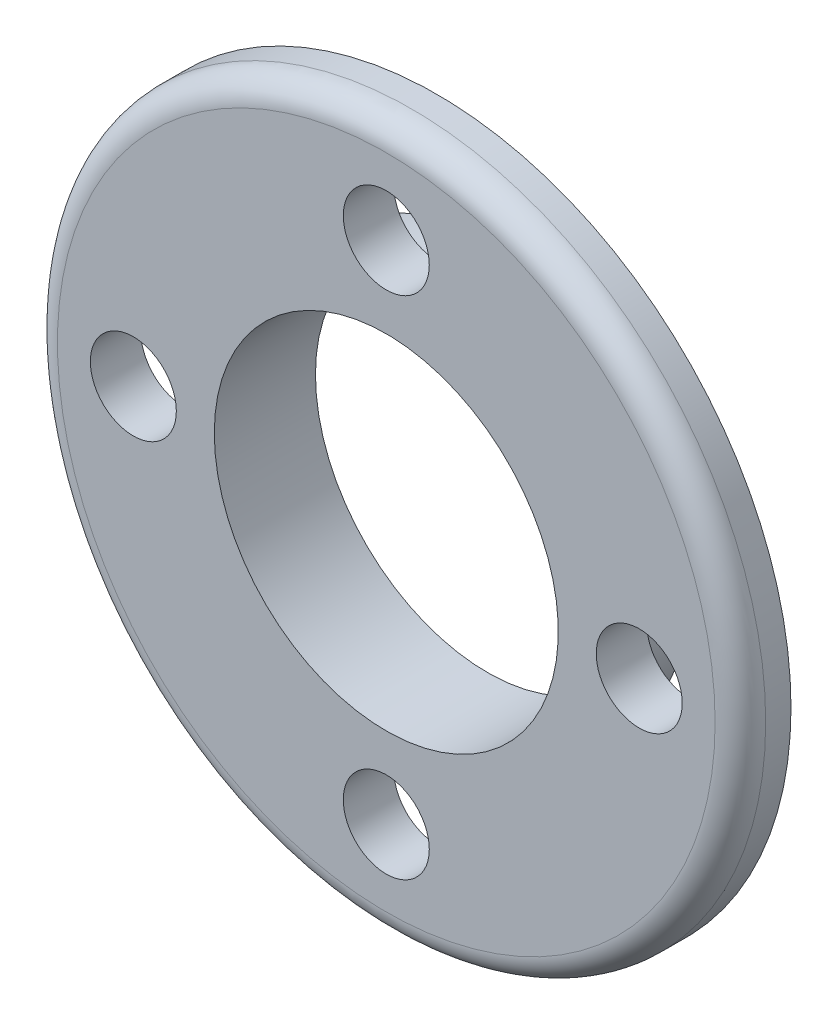
ISO-10303-21;
HEADER;
FILE_DESCRIPTION(('STEP AP214'),'2;1');
FILE_NAME('part.step','',(''),(''),'','','');
FILE_SCHEMA(('AUTOMOTIVE_DESIGN { 1 0 10303 214 1 1 1 1 }'));
ENDSEC;
DATA;
#1=APPLICATION_CONTEXT('core data for automotive mechanical design processes');
#2=APPLICATION_PROTOCOL_DEFINITION('international standard','automotive_design',2000,#1);
#3=PRODUCT_CONTEXT('',#1,'mechanical');
#4=PRODUCT('Part','Part','',(#3));
#5=PRODUCT_RELATED_PRODUCT_CATEGORY('part','',(#4));
#6=PRODUCT_DEFINITION_FORMATION('','',#4);
#7=PRODUCT_DEFINITION_CONTEXT('part definition',#1,'design');
#8=PRODUCT_DEFINITION('design','',#6,#7);
#9=PRODUCT_DEFINITION_SHAPE('','',#8);
#10=(LENGTH_UNIT() NAMED_UNIT(*) SI_UNIT(.MILLI.,.METRE.));
#11=(NAMED_UNIT(*) PLANE_ANGLE_UNIT() SI_UNIT($,.RADIAN.));
#12=(NAMED_UNIT(*) SI_UNIT($,.STERADIAN.) SOLID_ANGLE_UNIT());
#13=UNCERTAINTY_MEASURE_WITH_UNIT(LENGTH_MEASURE(1.E-05),#10,'distance_accuracy_value','');
#14=(GEOMETRIC_REPRESENTATION_CONTEXT(3) GLOBAL_UNCERTAINTY_ASSIGNED_CONTEXT((#13)) GLOBAL_UNIT_ASSIGNED_CONTEXT((#10,
#11,#12)) REPRESENTATION_CONTEXT('',''));
#15=CARTESIAN_POINT('',(0.,0.,0.));
#16=DIRECTION('',(0.,0.,1.));
#17=DIRECTION('',(1.,0.,0.));
#18=AXIS2_PLACEMENT_3D('',#15,#16,#17);
#19=CARTESIAN_POINT('',(0.,14.,1.));
#20=DIRECTION('',(0.,0.,1.));
#21=DIRECTION('',(1.,0.,0.));
#22=AXIS2_PLACEMENT_3D('',#19,#20,#21);
#23=PLANE('',#22);
#24=CARTESIAN_POINT('',(0.,0.,1.));
#25=DIRECTION('',(0.,0.,1.));
#26=DIRECTION('',(1.,0.,0.));
#27=AXIS2_PLACEMENT_3D('',#24,#25,#26);
#28=CIRCLE('',#27,13.);
#29=CARTESIAN_POINT('',(13.,0.,1.));
#30=VERTEX_POINT('',#29);
#31=EDGE_CURVE('E10',#30,#30,#28,.T.);
#32=ORIENTED_EDGE('',*,*,#31,.T.);
#33=EDGE_LOOP('',(#32));
#34=FACE_BOUND('',#33,.T.);
#35=CARTESIAN_POINT('',(1.04744440165294E-13,-10.,1.));
#36=DIRECTION('',(0.,0.,1.));
#37=DIRECTION('',(1.,0.,0.));
#38=AXIS2_PLACEMENT_3D('',#35,#36,#37);
#39=CIRCLE('',#38,1.7);
#40=CARTESIAN_POINT('',(1.7000000000001,-10.,1.));
#41=VERTEX_POINT('',#40);
#42=EDGE_CURVE('E101',#41,#41,#39,.T.);
#43=ORIENTED_EDGE('',*,*,#42,.F.);
#44=EDGE_LOOP('',(#43));
#45=FACE_BOUND('',#44,.T.);
#46=CARTESIAN_POINT('',(-10.,0.,1.));
#47=DIRECTION('',(0.,0.,1.));
#48=DIRECTION('',(1.,0.,0.));
#49=AXIS2_PLACEMENT_3D('',#46,#47,#48);
#50=CIRCLE('',#49,1.7);
#51=CARTESIAN_POINT('',(-8.3,0.,1.));
#52=VERTEX_POINT('',#51);
#53=EDGE_CURVE('E93',#52,#52,#50,.T.);
#54=ORIENTED_EDGE('',*,*,#53,.F.);
#55=EDGE_LOOP('',(#54));
#56=FACE_BOUND('',#55,.T.);
#57=CARTESIAN_POINT('',(0.,10.,1.));
#58=DIRECTION('',(0.,0.,1.));
#59=DIRECTION('',(1.,0.,0.));
#60=AXIS2_PLACEMENT_3D('',#57,#58,#59);
#61=CIRCLE('',#60,1.7);
#62=CARTESIAN_POINT('',(1.69999999999996,10.,1.));
#63=VERTEX_POINT('',#62);
#64=EDGE_CURVE('E63',#63,#63,#61,.T.);
#65=ORIENTED_EDGE('',*,*,#64,.F.);
#66=EDGE_LOOP('',(#65));
#67=FACE_BOUND('',#66,.T.);
#68=CARTESIAN_POINT('',(10.,0.,1.));
#69=DIRECTION('',(0.,0.,1.));
#70=DIRECTION('',(1.,0.,0.));
#71=AXIS2_PLACEMENT_3D('',#68,#69,#70);
#72=CIRCLE('',#71,1.7);
#73=CARTESIAN_POINT('',(11.7,0.,1.));
#74=VERTEX_POINT('',#73);
#75=EDGE_CURVE('E62',#74,#74,#72,.T.);
#76=ORIENTED_EDGE('',*,*,#75,.F.);
#77=EDGE_LOOP('',(#76));
#78=FACE_BOUND('',#77,.T.);
#79=CARTESIAN_POINT('',(0.,0.,1.));
#80=DIRECTION('',(0.,0.,-1.));
#81=DIRECTION('',(-1.,0.,0.));
#82=AXIS2_PLACEMENT_3D('',#79,#80,#81);
#83=CIRCLE('',#82,6.8);
#84=CARTESIAN_POINT('',(-6.8,0.,1.));
#85=VERTEX_POINT('',#84);
#86=EDGE_CURVE('E50',#85,#85,#83,.T.);
#87=ORIENTED_EDGE('',*,*,#86,.T.);
#88=EDGE_LOOP('',(#87));
#89=FACE_BOUND('',#88,.T.);
#90=ADVANCED_FACE('F37',(#34,#45,#56,#67,#78,#89),#23,.T.);
#91=CARTESIAN_POINT('',(0.,0.,-88.99));
#92=DIRECTION('',(0.,0.,-1.));
#93=DIRECTION('',(-1.,0.,0.));
#94=AXIS2_PLACEMENT_3D('',#91,#92,#93);
#95=CYLINDRICAL_SURFACE('',#94,6.8);
#96=CARTESIAN_POINT('',(0.,0.,-3.));
#97=DIRECTION('',(0.,0.,-1.));
#98=DIRECTION('',(-1.,0.,0.));
#99=AXIS2_PLACEMENT_3D('',#96,#97,#98);
#100=CIRCLE('',#99,6.8);
#101=CARTESIAN_POINT('',(-6.8,0.,-3.));
#102=VERTEX_POINT('',#101);
#103=EDGE_CURVE('E55',#102,#102,#100,.T.);
#104=ORIENTED_EDGE('',*,*,#103,.T.);
#105=EDGE_LOOP('',(#104));
#106=FACE_BOUND('',#105,.T.);
#107=ORIENTED_EDGE('',*,*,#86,.F.);
#108=EDGE_LOOP('',(#107));
#109=FACE_BOUND('',#108,.T.);
#110=ADVANCED_FACE('F110',(#106,#109),#95,.F.);
#111=CARTESIAN_POINT('',(0.,6.8,-3.));
#112=DIRECTION('',(0.,0.,-1.));
#113=DIRECTION('',(-1.,0.,0.));
#114=AXIS2_PLACEMENT_3D('',#111,#112,#113);
#115=PLANE('',#114);
#116=CARTESIAN_POINT('',(0.,0.,-3.));
#117=DIRECTION('',(0.,0.,-1.));
#118=DIRECTION('',(-1.,0.,0.));
#119=AXIS2_PLACEMENT_3D('',#116,#117,#118);
#120=CIRCLE('',#119,8.);
#121=CARTESIAN_POINT('',(-8.,0.,-3.));
#122=VERTEX_POINT('',#121);
#123=EDGE_CURVE('E72',#122,#122,#120,.T.);
#124=ORIENTED_EDGE('',*,*,#123,.T.);
#125=EDGE_LOOP('',(#124));
#126=FACE_BOUND('',#125,.T.);
#127=ORIENTED_EDGE('',*,*,#103,.F.);
#128=EDGE_LOOP('',(#127));
#129=FACE_BOUND('',#128,.T.);
#130=ADVANCED_FACE('F120',(#126,#129),#115,.T.);
#131=CARTESIAN_POINT('',(0.,0.,-88.99));
#132=DIRECTION('',(0.,0.,-1.));
#133=DIRECTION('',(-1.,0.,0.));
#134=AXIS2_PLACEMENT_3D('',#131,#132,#133);
#135=CYLINDRICAL_SURFACE('',#134,8.);
#136=CARTESIAN_POINT('',(0.,0.,-1.));
#137=DIRECTION('',(0.,0.,-1.));
#138=DIRECTION('',(-1.,0.,0.));
#139=AXIS2_PLACEMENT_3D('',#136,#137,#138);
#140=CIRCLE('',#139,8.);
#141=CARTESIAN_POINT('',(-8.,0.,-1.));
#142=VERTEX_POINT('',#141);
#143=EDGE_CURVE('E76',#142,#142,#140,.T.);
#144=ORIENTED_EDGE('',*,*,#143,.T.);
#145=EDGE_LOOP('',(#144));
#146=FACE_BOUND('',#145,.T.);
#147=ORIENTED_EDGE('',*,*,#123,.F.);
#148=EDGE_LOOP('',(#147));
#149=FACE_BOUND('',#148,.T.);
#150=ADVANCED_FACE('F126',(#146,#149),#135,.T.);
#151=CARTESIAN_POINT('',(0.,14.,-1.));
#152=DIRECTION('',(0.,0.,-1.));
#153=DIRECTION('',(-1.,0.,0.));
#154=AXIS2_PLACEMENT_3D('',#151,#152,#153);
#155=PLANE('',#154);
#156=CARTESIAN_POINT('',(1.04744440165294E-13,-10.,-1.));
#157=DIRECTION('',(0.,0.,-1.));
#158=DIRECTION('',(-1.,0.,0.));
#159=AXIS2_PLACEMENT_3D('',#156,#157,#158);
#160=CIRCLE('',#159,1.7);
#161=CARTESIAN_POINT('',(-1.69999999999989,-10.,-1.));
#162=VERTEX_POINT('',#161);
#163=EDGE_CURVE('E97',#162,#162,#160,.T.);
#164=ORIENTED_EDGE('',*,*,#163,.F.);
#165=EDGE_LOOP('',(#164));
#166=FACE_BOUND('',#165,.T.);
#167=CARTESIAN_POINT('',(-10.,0.,-1.));
#168=DIRECTION('',(0.,0.,-1.));
#169=DIRECTION('',(-1.,0.,0.));
#170=AXIS2_PLACEMENT_3D('',#167,#168,#169);
#171=CIRCLE('',#170,1.7);
#172=CARTESIAN_POINT('',(-11.7,0.,-1.));
#173=VERTEX_POINT('',#172);
#174=EDGE_CURVE('E89',#173,#173,#171,.T.);
#175=ORIENTED_EDGE('',*,*,#174,.F.);
#176=EDGE_LOOP('',(#175));
#177=FACE_BOUND('',#176,.T.);
#178=CARTESIAN_POINT('',(0.,10.,-1.));
#179=DIRECTION('',(0.,0.,-1.));
#180=DIRECTION('',(-1.,0.,0.));
#181=AXIS2_PLACEMENT_3D('',#178,#179,#180);
#182=CIRCLE('',#181,1.7);
#183=CARTESIAN_POINT('',(-1.70000000000003,10.,-1.));
#184=VERTEX_POINT('',#183);
#185=EDGE_CURVE('E58',#184,#184,#182,.T.);
#186=ORIENTED_EDGE('',*,*,#185,.F.);
#187=EDGE_LOOP('',(#186));
#188=FACE_BOUND('',#187,.T.);
#189=CARTESIAN_POINT('',(10.,0.,-1.));
#190=DIRECTION('',(0.,0.,-1.));
#191=DIRECTION('',(-1.,0.,0.));
#192=AXIS2_PLACEMENT_3D('',#189,#190,#191);
#193=CIRCLE('',#192,1.7);
#194=CARTESIAN_POINT('',(8.3,0.,-1.));
#195=VERTEX_POINT('',#194);
#196=EDGE_CURVE('E64',#195,#195,#193,.T.);
#197=ORIENTED_EDGE('',*,*,#196,.F.);
#198=EDGE_LOOP('',(#197));
#199=FACE_BOUND('',#198,.T.);
#200=CARTESIAN_POINT('',(0.,0.,-1.));
#201=DIRECTION('',(0.,0.,-1.));
#202=DIRECTION('',(-1.,0.,0.));
#203=AXIS2_PLACEMENT_3D('',#200,#201,#202);
#204=CIRCLE('',#203,14.);
#205=CARTESIAN_POINT('',(-14.,0.,-1.));
#206=VERTEX_POINT('',#205);
#207=EDGE_CURVE('E67',#206,#206,#204,.T.);
#208=ORIENTED_EDGE('',*,*,#207,.T.);
#209=EDGE_LOOP('',(#208));
#210=FACE_BOUND('',#209,.T.);
#211=ORIENTED_EDGE('',*,*,#143,.F.);
#212=EDGE_LOOP('',(#211));
#213=FACE_BOUND('',#212,.T.);
#214=ADVANCED_FACE('F132',(#166,#177,#188,#199,#210,#213),#155,.T.);
#215=CARTESIAN_POINT('',(0.,0.,-88.99));
#216=DIRECTION('',(0.,0.,-1.));
#217=DIRECTION('',(-1.,0.,0.));
#218=AXIS2_PLACEMENT_3D('',#215,#216,#217);
#219=CYLINDRICAL_SURFACE('',#218,14.);
#220=CARTESIAN_POINT('',(0.,0.,0.));
#221=DIRECTION('',(0.,0.,1.));
#222=DIRECTION('',(1.,0.,0.));
#223=AXIS2_PLACEMENT_3D('',#220,#221,#222);
#224=CIRCLE('',#223,14.);
#225=CARTESIAN_POINT('',(14.,0.,0.));
#226=VERTEX_POINT('',#225);
#227=EDGE_CURVE('E45',#226,#226,#224,.F.);
#228=ORIENTED_EDGE('',*,*,#227,.T.);
#229=EDGE_LOOP('',(#228));
#230=FACE_BOUND('',#229,.T.);
#231=ORIENTED_EDGE('',*,*,#207,.F.);
#232=EDGE_LOOP('',(#231));
#233=FACE_BOUND('',#232,.T.);
#234=ADVANCED_FACE('F136',(#230,#233),#219,.T.);
#235=CARTESIAN_POINT('',(10.,0.,1.));
#236=DIRECTION('',(0.,0.,1.));
#237=DIRECTION('',(1.,0.,0.));
#238=AXIS2_PLACEMENT_3D('',#235,#236,#237);
#239=CYLINDRICAL_SURFACE('',#238,1.7);
#240=ORIENTED_EDGE('',*,*,#196,.T.);
#241=EDGE_LOOP('',(#240));
#242=FACE_BOUND('',#241,.T.);
#243=ORIENTED_EDGE('',*,*,#75,.T.);
#244=EDGE_LOOP('',(#243));
#245=FACE_BOUND('',#244,.T.);
#246=ADVANCED_FACE('F140',(#242,#245),#239,.F.);
#247=CARTESIAN_POINT('',(0.,10.,1.));
#248=DIRECTION('',(0.,0.,1.));
#249=DIRECTION('',(1.,0.,0.));
#250=AXIS2_PLACEMENT_3D('',#247,#248,#249);
#251=CYLINDRICAL_SURFACE('',#250,1.7);
#252=ORIENTED_EDGE('',*,*,#185,.T.);
#253=EDGE_LOOP('',(#252));
#254=FACE_BOUND('',#253,.T.);
#255=ORIENTED_EDGE('',*,*,#64,.T.);
#256=EDGE_LOOP('',(#255));
#257=FACE_BOUND('',#256,.T.);
#258=ADVANCED_FACE('F143',(#254,#257),#251,.F.);
#259=CARTESIAN_POINT('',(-10.,0.,1.));
#260=DIRECTION('',(0.,0.,1.));
#261=DIRECTION('',(1.,0.,0.));
#262=AXIS2_PLACEMENT_3D('',#259,#260,#261);
#263=CYLINDRICAL_SURFACE('',#262,1.7);
#264=ORIENTED_EDGE('',*,*,#174,.T.);
#265=EDGE_LOOP('',(#264));
#266=FACE_BOUND('',#265,.T.);
#267=ORIENTED_EDGE('',*,*,#53,.T.);
#268=EDGE_LOOP('',(#267));
#269=FACE_BOUND('',#268,.T.);
#270=ADVANCED_FACE('F147',(#266,#269),#263,.F.);
#271=CARTESIAN_POINT('',(1.04744440165294E-13,-10.,1.));
#272=DIRECTION('',(0.,0.,1.));
#273=DIRECTION('',(1.,0.,0.));
#274=AXIS2_PLACEMENT_3D('',#271,#272,#273);
#275=CYLINDRICAL_SURFACE('',#274,1.7);
#276=ORIENTED_EDGE('',*,*,#163,.T.);
#277=EDGE_LOOP('',(#276));
#278=FACE_BOUND('',#277,.T.);
#279=ORIENTED_EDGE('',*,*,#42,.T.);
#280=EDGE_LOOP('',(#279));
#281=FACE_BOUND('',#280,.T.);
#282=ADVANCED_FACE('F106',(#278,#281),#275,.F.);
#283=CARTESIAN_POINT('',(0.,0.,0.));
#284=DIRECTION('',(0.,0.,1.));
#285=DIRECTION('',(1.,0.,0.));
#286=AXIS2_PLACEMENT_3D('',#283,#284,#285);
#287=TOROIDAL_SURFACE('',#286,13.,1.);
#288=ORIENTED_EDGE('',*,*,#31,.F.);
#289=EDGE_LOOP('',(#288));
#290=FACE_BOUND('',#289,.T.);
#291=ORIENTED_EDGE('',*,*,#227,.F.);
#292=EDGE_LOOP('',(#291));
#293=FACE_BOUND('',#292,.T.);
#294=ADVANCED_FACE('F39',(#290,#293),#287,.T.);
#295=CLOSED_SHELL('',(#90,#110,#130,#150,#214,#234,#246,#258,#270,#282,#294));
#296=MANIFOLD_SOLID_BREP('B2',#295);
#297=ADVANCED_BREP_SHAPE_REPRESENTATION('',(#18,#296),#14);
#298=SHAPE_DEFINITION_REPRESENTATION(#9,#297);
ENDSEC;
END-ISO-10303-21;
